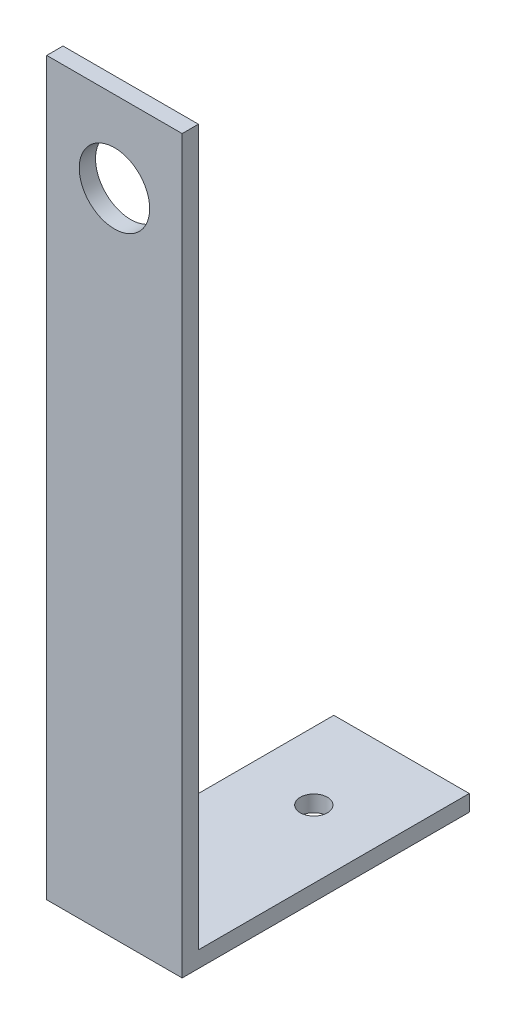
ISO-10303-21;
HEADER;
FILE_DESCRIPTION(('STEP AP214'),'2;1');
FILE_NAME('part.step','',(''),(''),'','','');
FILE_SCHEMA(('AUTOMOTIVE_DESIGN { 1 0 10303 214 1 1 1 1 }'));
ENDSEC;
DATA;
#1=APPLICATION_CONTEXT('core data for automotive mechanical design processes');
#2=APPLICATION_PROTOCOL_DEFINITION('international standard','automotive_design',2000,#1);
#3=PRODUCT_CONTEXT('',#1,'mechanical');
#4=PRODUCT('Part','Part','',(#3));
#5=PRODUCT_RELATED_PRODUCT_CATEGORY('part','',(#4));
#6=PRODUCT_DEFINITION_FORMATION('','',#4);
#7=PRODUCT_DEFINITION_CONTEXT('part definition',#1,'design');
#8=PRODUCT_DEFINITION('design','',#6,#7);
#9=PRODUCT_DEFINITION_SHAPE('','',#8);
#10=(LENGTH_UNIT() NAMED_UNIT(*) SI_UNIT(.MILLI.,.METRE.));
#11=(NAMED_UNIT(*) PLANE_ANGLE_UNIT() SI_UNIT($,.RADIAN.));
#12=(NAMED_UNIT(*) SI_UNIT($,.STERADIAN.) SOLID_ANGLE_UNIT());
#13=UNCERTAINTY_MEASURE_WITH_UNIT(LENGTH_MEASURE(1.E-05),#10,'distance_accuracy_value','');
#14=(GEOMETRIC_REPRESENTATION_CONTEXT(3) GLOBAL_UNCERTAINTY_ASSIGNED_CONTEXT((#13)) GLOBAL_UNIT_ASSIGNED_CONTEXT((#10,
#11,#12)) REPRESENTATION_CONTEXT('',''));
#15=CARTESIAN_POINT('',(0.,0.,0.));
#16=DIRECTION('',(0.,0.,1.));
#17=DIRECTION('',(1.,0.,0.));
#18=AXIS2_PLACEMENT_3D('',#15,#16,#17);
#19=CARTESIAN_POINT('',(25.,6.,50.));
#20=DIRECTION('',(-1.,0.,0.));
#21=DIRECTION('',(0.,0.,1.));
#22=AXIS2_PLACEMENT_3D('',#19,#20,#21);
#23=PLANE('',#22);
#24=DIRECTION('',(0.,0.,-1.));
#25=VECTOR('',#24,1.);
#26=CARTESIAN_POINT('',(25.,0.,50.));
#27=LINE('',#26,#25);
#28=CARTESIAN_POINT('',(25.,0.,56.));
#29=VERTEX_POINT('',#28);
#30=CARTESIAN_POINT('',(25.,0.,-50.));
#31=VERTEX_POINT('',#30);
#32=EDGE_CURVE('E99',#29,#31,#27,.T.);
#33=ORIENTED_EDGE('',*,*,#32,.T.);
#34=DIRECTION('',(0.,-1.,0.));
#35=VECTOR('',#34,1.);
#36=CARTESIAN_POINT('',(25.,6.,-50.));
#37=LINE('',#36,#35);
#38=CARTESIAN_POINT('',(25.,6.,-50.));
#39=VERTEX_POINT('',#38);
#40=EDGE_CURVE('E11',#39,#31,#37,.T.);
#41=ORIENTED_EDGE('',*,*,#40,.F.);
#42=DIRECTION('',(0.,0.,-1.));
#43=VECTOR('',#42,1.);
#44=CARTESIAN_POINT('',(25.,6.,50.));
#45=LINE('',#44,#43);
#46=CARTESIAN_POINT('',(25.,6.,50.));
#47=VERTEX_POINT('',#46);
#48=EDGE_CURVE('E91',#47,#39,#45,.T.);
#49=ORIENTED_EDGE('',*,*,#48,.F.);
#50=DIRECTION('',(0.,-1.,0.));
#51=VECTOR('',#50,1.);
#52=CARTESIAN_POINT('',(25.,270.,50.));
#53=LINE('',#52,#51);
#54=CARTESIAN_POINT('',(25.,270.,50.));
#55=VERTEX_POINT('',#54);
#56=EDGE_CURVE('E53',#55,#47,#53,.T.);
#57=ORIENTED_EDGE('',*,*,#56,.F.);
#58=DIRECTION('',(0.,0.,1.));
#59=VECTOR('',#58,1.);
#60=CARTESIAN_POINT('',(25.,270.,0.));
#61=LINE('',#60,#59);
#62=CARTESIAN_POINT('',(25.,270.,56.));
#63=VERTEX_POINT('',#62);
#64=EDGE_CURVE('E136',#55,#63,#61,.T.);
#65=ORIENTED_EDGE('',*,*,#64,.T.);
#66=DIRECTION('',(0.,-1.,0.));
#67=VECTOR('',#66,1.);
#68=CARTESIAN_POINT('',(25.,270.,56.));
#69=LINE('',#68,#67);
#70=EDGE_CURVE('E103',#63,#29,#69,.T.);
#71=ORIENTED_EDGE('',*,*,#70,.T.);
#72=EDGE_LOOP('',(#33,#41,#49,#57,#65,#71));
#73=FACE_BOUND('',#72,.T.);
#74=ADVANCED_FACE('F35',(#73),#23,.F.);
#75=CARTESIAN_POINT('',(-25.,6.,-50.));
#76=DIRECTION('',(0.,0.,1.));
#77=DIRECTION('',(1.,0.,0.));
#78=AXIS2_PLACEMENT_3D('',#75,#76,#77);
#79=PLANE('',#78);
#80=DIRECTION('',(-1.,0.,0.));
#81=VECTOR('',#80,1.);
#82=CARTESIAN_POINT('',(-25.,0.,-50.));
#83=LINE('',#82,#81);
#84=CARTESIAN_POINT('',(-25.,0.,-50.));
#85=VERTEX_POINT('',#84);
#86=EDGE_CURVE('E66',#31,#85,#83,.T.);
#87=ORIENTED_EDGE('',*,*,#86,.T.);
#88=DIRECTION('',(0.,-1.,0.));
#89=VECTOR('',#88,1.);
#90=CARTESIAN_POINT('',(-25.,6.,-50.));
#91=LINE('',#90,#89);
#92=CARTESIAN_POINT('',(-25.,6.,-50.));
#93=VERTEX_POINT('',#92);
#94=EDGE_CURVE('E44',#93,#85,#91,.T.);
#95=ORIENTED_EDGE('',*,*,#94,.F.);
#96=DIRECTION('',(-1.,0.,0.));
#97=VECTOR('',#96,1.);
#98=CARTESIAN_POINT('',(-25.,6.,-50.));
#99=LINE('',#98,#97);
#100=EDGE_CURVE('E81',#39,#93,#99,.T.);
#101=ORIENTED_EDGE('',*,*,#100,.F.);
#102=ORIENTED_EDGE('',*,*,#40,.T.);
#103=EDGE_LOOP('',(#87,#95,#101,#102));
#104=FACE_BOUND('',#103,.T.);
#105=ADVANCED_FACE('F83',(#104),#79,.F.);
#106=CARTESIAN_POINT('',(-25.,6.,50.));
#107=DIRECTION('',(1.,0.,0.));
#108=DIRECTION('',(0.,0.,-1.));
#109=AXIS2_PLACEMENT_3D('',#106,#107,#108);
#110=PLANE('',#109);
#111=DIRECTION('',(0.,0.,1.));
#112=VECTOR('',#111,1.);
#113=CARTESIAN_POINT('',(-25.,0.,50.));
#114=LINE('',#113,#112);
#115=CARTESIAN_POINT('',(-25.,0.,56.));
#116=VERTEX_POINT('',#115);
#117=EDGE_CURVE('E96',#85,#116,#114,.T.);
#118=ORIENTED_EDGE('',*,*,#117,.T.);
#119=DIRECTION('',(0.,-1.,0.));
#120=VECTOR('',#119,1.);
#121=CARTESIAN_POINT('',(-25.,270.,56.));
#122=LINE('',#121,#120);
#123=CARTESIAN_POINT('',(-25.,270.,56.));
#124=VERTEX_POINT('',#123);
#125=EDGE_CURVE('E106',#124,#116,#122,.T.);
#126=ORIENTED_EDGE('',*,*,#125,.F.);
#127=DIRECTION('',(0.,0.,1.));
#128=VECTOR('',#127,1.);
#129=CARTESIAN_POINT('',(-25.,270.,0.));
#130=LINE('',#129,#128);
#131=CARTESIAN_POINT('',(-25.,270.,50.));
#132=VERTEX_POINT('',#131);
#133=EDGE_CURVE('E122',#132,#124,#130,.T.);
#134=ORIENTED_EDGE('',*,*,#133,.F.);
#135=DIRECTION('',(0.,-1.,0.));
#136=VECTOR('',#135,1.);
#137=CARTESIAN_POINT('',(-25.,270.,50.));
#138=LINE('',#137,#136);
#139=CARTESIAN_POINT('',(-25.,6.00000000000001,50.));
#140=VERTEX_POINT('',#139);
#141=EDGE_CURVE('E140',#132,#140,#138,.T.);
#142=ORIENTED_EDGE('',*,*,#141,.T.);
#143=DIRECTION('',(0.,0.,1.));
#144=VECTOR('',#143,1.);
#145=CARTESIAN_POINT('',(-25.,6.,50.));
#146=LINE('',#145,#144);
#147=EDGE_CURVE('E90',#93,#140,#146,.T.);
#148=ORIENTED_EDGE('',*,*,#147,.F.);
#149=ORIENTED_EDGE('',*,*,#94,.T.);
#150=EDGE_LOOP('',(#118,#126,#134,#142,#148,#149));
#151=FACE_BOUND('',#150,.T.);
#152=ADVANCED_FACE('F145',(#151),#110,.F.);
#153=CARTESIAN_POINT('',(0.,6.,0.));
#154=DIRECTION('',(0.,-1.,0.));
#155=DIRECTION('',(0.,0.,-1.));
#156=AXIS2_PLACEMENT_3D('',#153,#154,#155);
#157=PLANE('',#156);
#158=CARTESIAN_POINT('',(0.,6.,-17.6163636363637));
#159=DIRECTION('',(0.,1.,0.));
#160=DIRECTION('',(0.,0.,1.));
#161=AXIS2_PLACEMENT_3D('',#158,#159,#160);
#162=CIRCLE('',#161,5.);
#163=CARTESIAN_POINT('',(0.,6.,-12.6163636363637));
#164=VERTEX_POINT('',#163);
#165=EDGE_CURVE('E129',#164,#164,#162,.T.);
#166=ORIENTED_EDGE('',*,*,#165,.F.);
#167=EDGE_LOOP('',(#166));
#168=FACE_BOUND('',#167,.T.);
#169=ORIENTED_EDGE('',*,*,#48,.T.);
#170=ORIENTED_EDGE('',*,*,#100,.T.);
#171=ORIENTED_EDGE('',*,*,#147,.T.);
#172=DIRECTION('',(1.,0.,0.));
#173=VECTOR('',#172,1.);
#174=CARTESIAN_POINT('',(-25.,6.,50.));
#175=LINE('',#174,#173);
#176=EDGE_CURVE('E70',#140,#47,#175,.T.);
#177=ORIENTED_EDGE('',*,*,#176,.T.);
#178=EDGE_LOOP('',(#169,#170,#171,#177));
#179=FACE_BOUND('',#178,.T.);
#180=ADVANCED_FACE('F94',(#168,#179),#157,.F.);
#181=CARTESIAN_POINT('',(0.,0.,0.));
#182=DIRECTION('',(0.,-1.,0.));
#183=DIRECTION('',(0.,0.,-1.));
#184=AXIS2_PLACEMENT_3D('',#181,#182,#183);
#185=PLANE('',#184);
#186=CARTESIAN_POINT('',(0.,0.,-17.6163636363637));
#187=DIRECTION('',(0.,-1.,0.));
#188=DIRECTION('',(0.,0.,-1.));
#189=AXIS2_PLACEMENT_3D('',#186,#187,#188);
#190=CIRCLE('',#189,5.);
#191=CARTESIAN_POINT('',(0.,0.,-22.6163636363637));
#192=VERTEX_POINT('',#191);
#193=EDGE_CURVE('E38',#192,#192,#190,.T.);
#194=ORIENTED_EDGE('',*,*,#193,.F.);
#195=EDGE_LOOP('',(#194));
#196=FACE_BOUND('',#195,.T.);
#197=ORIENTED_EDGE('',*,*,#32,.F.);
#198=DIRECTION('',(-1.,0.,0.));
#199=VECTOR('',#198,1.);
#200=CARTESIAN_POINT('',(0.,0.,56.));
#201=LINE('',#200,#199);
#202=EDGE_CURVE('E118',#29,#116,#201,.T.);
#203=ORIENTED_EDGE('',*,*,#202,.T.);
#204=ORIENTED_EDGE('',*,*,#117,.F.);
#205=ORIENTED_EDGE('',*,*,#86,.F.);
#206=EDGE_LOOP('',(#197,#203,#204,#205));
#207=FACE_BOUND('',#206,.T.);
#208=ADVANCED_FACE('F160',(#196,#207),#185,.T.);
#209=CARTESIAN_POINT('',(0.,270.,56.));
#210=DIRECTION('',(0.,0.,1.));
#211=DIRECTION('',(1.,0.,0.));
#212=AXIS2_PLACEMENT_3D('',#209,#210,#211);
#213=PLANE('',#212);
#214=CARTESIAN_POINT('',(0.,240.,56.));
#215=DIRECTION('',(0.,0.,1.));
#216=DIRECTION('',(1.,0.,0.));
#217=AXIS2_PLACEMENT_3D('',#214,#215,#216);
#218=CIRCLE('',#217,13.);
#219=CARTESIAN_POINT('',(13.,240.,56.));
#220=VERTEX_POINT('',#219);
#221=EDGE_CURVE('E119',#220,#220,#218,.T.);
#222=ORIENTED_EDGE('',*,*,#221,.F.);
#223=EDGE_LOOP('',(#222));
#224=FACE_BOUND('',#223,.T.);
#225=ORIENTED_EDGE('',*,*,#202,.F.);
#226=ORIENTED_EDGE('',*,*,#70,.F.);
#227=DIRECTION('',(-1.,0.,0.));
#228=VECTOR('',#227,1.);
#229=CARTESIAN_POINT('',(0.,270.,56.));
#230=LINE('',#229,#228);
#231=EDGE_CURVE('E138',#63,#124,#230,.T.);
#232=ORIENTED_EDGE('',*,*,#231,.T.);
#233=ORIENTED_EDGE('',*,*,#125,.T.);
#234=EDGE_LOOP('',(#225,#226,#232,#233));
#235=FACE_BOUND('',#234,.T.);
#236=ADVANCED_FACE('F157',(#224,#235),#213,.T.);
#237=CARTESIAN_POINT('',(0.,270.,50.));
#238=DIRECTION('',(0.,0.,1.));
#239=DIRECTION('',(1.,0.,0.));
#240=AXIS2_PLACEMENT_3D('',#237,#238,#239);
#241=PLANE('',#240);
#242=CARTESIAN_POINT('',(0.,240.,50.));
#243=DIRECTION('',(0.,0.,1.));
#244=DIRECTION('',(1.,0.,0.));
#245=AXIS2_PLACEMENT_3D('',#242,#243,#244);
#246=CIRCLE('',#245,13.);
#247=CARTESIAN_POINT('',(13.,240.,50.));
#248=VERTEX_POINT('',#247);
#249=EDGE_CURVE('E116',#248,#248,#246,.T.);
#250=ORIENTED_EDGE('',*,*,#249,.T.);
#251=EDGE_LOOP('',(#250));
#252=FACE_BOUND('',#251,.T.);
#253=ORIENTED_EDGE('',*,*,#176,.F.);
#254=ORIENTED_EDGE('',*,*,#141,.F.);
#255=DIRECTION('',(-1.,0.,0.));
#256=VECTOR('',#255,1.);
#257=CARTESIAN_POINT('',(0.,270.,50.));
#258=LINE('',#257,#256);
#259=EDGE_CURVE('E133',#55,#132,#258,.T.);
#260=ORIENTED_EDGE('',*,*,#259,.F.);
#261=ORIENTED_EDGE('',*,*,#56,.T.);
#262=EDGE_LOOP('',(#253,#254,#260,#261));
#263=FACE_BOUND('',#262,.T.);
#264=ADVANCED_FACE('F149',(#252,#263),#241,.F.);
#265=CARTESIAN_POINT('',(0.,270.,0.));
#266=DIRECTION('',(0.,-1.,0.));
#267=DIRECTION('',(0.,0.,-1.));
#268=AXIS2_PLACEMENT_3D('',#265,#266,#267);
#269=PLANE('',#268);
#270=ORIENTED_EDGE('',*,*,#133,.T.);
#271=ORIENTED_EDGE('',*,*,#231,.F.);
#272=ORIENTED_EDGE('',*,*,#64,.F.);
#273=ORIENTED_EDGE('',*,*,#259,.T.);
#274=EDGE_LOOP('',(#270,#271,#272,#273));
#275=FACE_BOUND('',#274,.T.);
#276=ADVANCED_FACE('F159',(#275),#269,.F.);
#277=CARTESIAN_POINT('',(0.,240.,-50.));
#278=DIRECTION('',(0.,0.,1.));
#279=DIRECTION('',(1.,0.,0.));
#280=AXIS2_PLACEMENT_3D('',#277,#278,#279);
#281=CYLINDRICAL_SURFACE('',#280,13.);
#282=ORIENTED_EDGE('',*,*,#221,.T.);
#283=EDGE_LOOP('',(#282));
#284=FACE_BOUND('',#283,.T.);
#285=ORIENTED_EDGE('',*,*,#249,.F.);
#286=EDGE_LOOP('',(#285));
#287=FACE_BOUND('',#286,.T.);
#288=ADVANCED_FACE('F195',(#284,#287),#281,.F.);
#289=CARTESIAN_POINT('',(0.,-4.,-17.6163636363637));
#290=DIRECTION('',(0.,1.,0.));
#291=DIRECTION('',(0.,0.,1.));
#292=AXIS2_PLACEMENT_3D('',#289,#290,#291);
#293=CYLINDRICAL_SURFACE('',#292,5.);
#294=ORIENTED_EDGE('',*,*,#193,.T.);
#295=EDGE_LOOP('',(#294));
#296=FACE_BOUND('',#295,.T.);
#297=ORIENTED_EDGE('',*,*,#165,.T.);
#298=EDGE_LOOP('',(#297));
#299=FACE_BOUND('',#298,.T.);
#300=ADVANCED_FACE('F206',(#296,#299),#293,.F.);
#301=CLOSED_SHELL('',(#74,#105,#152,#180,#208,#236,#264,#276,#288,#300));
#302=MANIFOLD_SOLID_BREP('B2',#301);
#303=ADVANCED_BREP_SHAPE_REPRESENTATION('',(#18,#302),#14);
#304=SHAPE_DEFINITION_REPRESENTATION(#9,#303);
ENDSEC;
END-ISO-10303-21;
